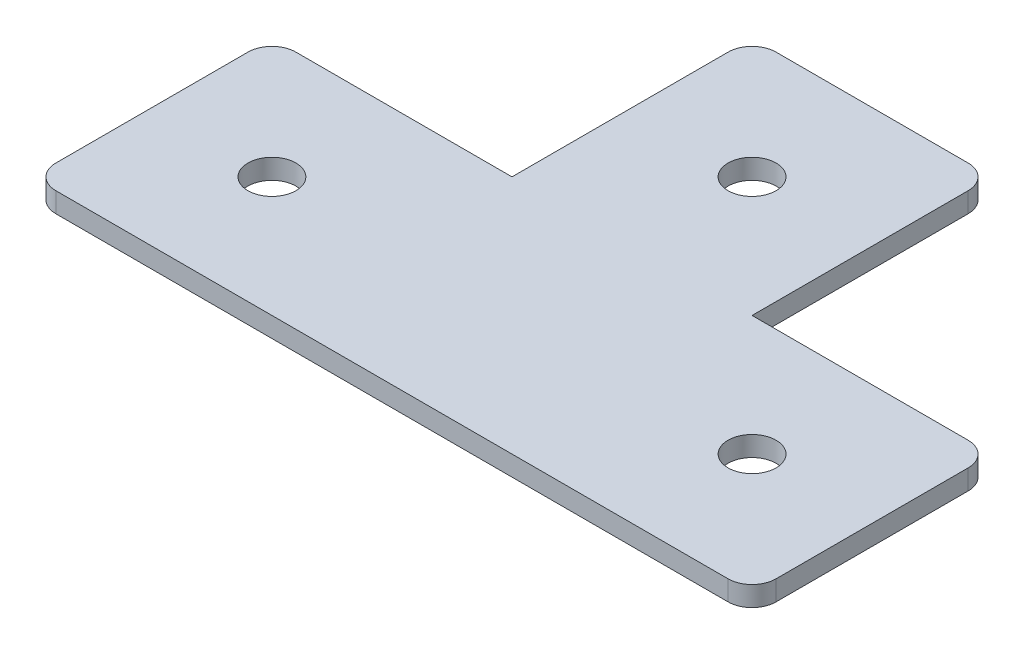
ISO-10303-21;
HEADER;
FILE_DESCRIPTION(('STEP AP214'),'2;1');
FILE_NAME('part.step','',(''),(''),'','','');
FILE_SCHEMA(('AUTOMOTIVE_DESIGN { 1 0 10303 214 1 1 1 1 }'));
ENDSEC;
DATA;
#1=APPLICATION_CONTEXT('core data for automotive mechanical design processes');
#2=APPLICATION_PROTOCOL_DEFINITION('international standard','automotive_design',2000,#1);
#3=PRODUCT_CONTEXT('',#1,'mechanical');
#4=PRODUCT('Part','Part','',(#3));
#5=PRODUCT_RELATED_PRODUCT_CATEGORY('part','',(#4));
#6=PRODUCT_DEFINITION_FORMATION('','',#4);
#7=PRODUCT_DEFINITION_CONTEXT('part definition',#1,'design');
#8=PRODUCT_DEFINITION('design','',#6,#7);
#9=PRODUCT_DEFINITION_SHAPE('','',#8);
#10=(LENGTH_UNIT() NAMED_UNIT(*) SI_UNIT(.MILLI.,.METRE.));
#11=(NAMED_UNIT(*) PLANE_ANGLE_UNIT() SI_UNIT($,.RADIAN.));
#12=(NAMED_UNIT(*) SI_UNIT($,.STERADIAN.) SOLID_ANGLE_UNIT());
#13=UNCERTAINTY_MEASURE_WITH_UNIT(LENGTH_MEASURE(1.E-05),#10,'distance_accuracy_value','');
#14=(GEOMETRIC_REPRESENTATION_CONTEXT(3) GLOBAL_UNCERTAINTY_ASSIGNED_CONTEXT((#13)) GLOBAL_UNIT_ASSIGNED_CONTEXT((#10,
#11,#12)) REPRESENTATION_CONTEXT('',''));
#15=CARTESIAN_POINT('',(0.,0.,0.));
#16=DIRECTION('',(0.,0.,1.));
#17=DIRECTION('',(1.,0.,0.));
#18=AXIS2_PLACEMENT_3D('',#15,#16,#17);
#19=CARTESIAN_POINT('',(-12.4698795180723,2.5,-24.8493975903614));
#20=DIRECTION('',(1.,0.,0.));
#21=DIRECTION('',(0.,0.,-1.));
#22=AXIS2_PLACEMENT_3D('',#19,#20,#21);
#23=PLANE('',#22);
#24=DIRECTION('',(0.,0.,1.));
#25=VECTOR('',#24,1.);
#26=CARTESIAN_POINT('',(-12.4698795180723,2.5,-24.8493975903614));
#27=LINE('',#26,#25);
#28=CARTESIAN_POINT('',(-12.4698795180723,2.5,-21.8493975903615));
#29=VERTEX_POINT('',#28);
#30=CARTESIAN_POINT('',(-12.4698795180723,2.5,5.15060240963856));
#31=VERTEX_POINT('',#30);
#32=EDGE_CURVE('E134',#29,#31,#27,.T.);
#33=ORIENTED_EDGE('',*,*,#32,.F.);
#34=DIRECTION('',(0.,-1.,0.));
#35=VECTOR('',#34,1.);
#36=CARTESIAN_POINT('',(-12.4698795180723,2.5,-21.8493975903615));
#37=LINE('',#36,#35);
#38=CARTESIAN_POINT('',(-12.4698795180723,0.,-21.8493975903615));
#39=VERTEX_POINT('',#38);
#40=EDGE_CURVE('E193',#29,#39,#37,.T.);
#41=ORIENTED_EDGE('',*,*,#40,.T.);
#42=DIRECTION('',(0.,0.,1.));
#43=VECTOR('',#42,1.);
#44=CARTESIAN_POINT('',(-12.4698795180723,0.,-24.8493975903614));
#45=LINE('',#44,#43);
#46=CARTESIAN_POINT('',(-12.4698795180723,0.,5.15060240963856));
#47=VERTEX_POINT('',#46);
#48=EDGE_CURVE('E158',#39,#47,#45,.T.);
#49=ORIENTED_EDGE('',*,*,#48,.T.);
#50=DIRECTION('',(0.,-1.,0.));
#51=VECTOR('',#50,1.);
#52=CARTESIAN_POINT('',(-12.4698795180723,2.5,5.15060240963856));
#53=LINE('',#52,#51);
#54=EDGE_CURVE('E152',#31,#47,#53,.T.);
#55=ORIENTED_EDGE('',*,*,#54,.F.);
#56=EDGE_LOOP('',(#33,#41,#49,#55));
#57=FACE_BOUND('',#56,.T.);
#58=ADVANCED_FACE('F33',(#57),#23,.F.);
#59=CARTESIAN_POINT('',(-12.4698795180723,2.5,5.15060240963856));
#60=DIRECTION('',(0.,0.,1.));
#61=DIRECTION('',(1.,0.,0.));
#62=AXIS2_PLACEMENT_3D('',#59,#60,#61);
#63=PLANE('',#62);
#64=DIRECTION('',(-1.,0.,0.));
#65=VECTOR('',#64,1.);
#66=CARTESIAN_POINT('',(-12.4698795180723,0.,5.15060240963856));
#67=LINE('',#66,#65);
#68=CARTESIAN_POINT('',(-39.4698795180723,0.,5.15060240963856));
#69=VERTEX_POINT('',#68);
#70=EDGE_CURVE('E250',#47,#69,#67,.T.);
#71=ORIENTED_EDGE('',*,*,#70,.T.);
#72=DIRECTION('',(0.,-1.,0.));
#73=VECTOR('',#72,1.);
#74=CARTESIAN_POINT('',(-39.4698795180723,2.5,5.15060240963856));
#75=LINE('',#74,#73);
#76=CARTESIAN_POINT('',(-39.4698795180723,2.5,5.15060240963856));
#77=VERTEX_POINT('',#76);
#78=EDGE_CURVE('E154',#69,#77,#75,.F.);
#79=ORIENTED_EDGE('',*,*,#78,.T.);
#80=DIRECTION('',(-1.,0.,0.));
#81=VECTOR('',#80,1.);
#82=CARTESIAN_POINT('',(-12.4698795180723,2.5,5.15060240963856));
#83=LINE('',#82,#81);
#84=EDGE_CURVE('E137',#31,#77,#83,.T.);
#85=ORIENTED_EDGE('',*,*,#84,.F.);
#86=ORIENTED_EDGE('',*,*,#54,.T.);
#87=EDGE_LOOP('',(#71,#79,#85,#86));
#88=FACE_BOUND('',#87,.T.);
#89=ADVANCED_FACE('F151',(#88),#63,.F.);
#90=CARTESIAN_POINT('',(-42.4698795180723,2.5,35.1506024096386));
#91=DIRECTION('',(1.,0.,0.));
#92=DIRECTION('',(0.,0.,-1.));
#93=AXIS2_PLACEMENT_3D('',#90,#91,#92);
#94=PLANE('',#93);
#95=DIRECTION('',(0.,0.,1.));
#96=VECTOR('',#95,1.);
#97=CARTESIAN_POINT('',(-42.4698795180723,0.,35.1506024096386));
#98=LINE('',#97,#96);
#99=CARTESIAN_POINT('',(-42.4698795180723,0.,8.15060240963856));
#100=VERTEX_POINT('',#99);
#101=CARTESIAN_POINT('',(-42.4698795180723,0.,32.1506024096385));
#102=VERTEX_POINT('',#101);
#103=EDGE_CURVE('E252',#100,#102,#98,.T.);
#104=ORIENTED_EDGE('',*,*,#103,.T.);
#105=DIRECTION('',(0.,-1.,0.));
#106=VECTOR('',#105,1.);
#107=CARTESIAN_POINT('',(-42.4698795180723,2.5,32.1506024096385));
#108=LINE('',#107,#106);
#109=CARTESIAN_POINT('',(-42.4698795180723,2.5,32.1506024096385));
#110=VERTEX_POINT('',#109);
#111=EDGE_CURVE('E180',#102,#110,#108,.F.);
#112=ORIENTED_EDGE('',*,*,#111,.T.);
#113=DIRECTION('',(0.,0.,1.));
#114=VECTOR('',#113,1.);
#115=CARTESIAN_POINT('',(-42.4698795180723,2.5,35.1506024096386));
#116=LINE('',#115,#114);
#117=CARTESIAN_POINT('',(-42.4698795180723,2.5,8.15060240963856));
#118=VERTEX_POINT('',#117);
#119=EDGE_CURVE('E155',#118,#110,#116,.T.);
#120=ORIENTED_EDGE('',*,*,#119,.F.);
#121=DIRECTION('',(0.,-1.,0.));
#122=VECTOR('',#121,1.);
#123=CARTESIAN_POINT('',(-42.4698795180723,2.5,8.15060240963856));
#124=LINE('',#123,#122);
#125=EDGE_CURVE('E160',#118,#100,#124,.T.);
#126=ORIENTED_EDGE('',*,*,#125,.T.);
#127=EDGE_LOOP('',(#104,#112,#120,#126));
#128=FACE_BOUND('',#127,.T.);
#129=ADVANCED_FACE('F299',(#128),#94,.F.);
#130=CARTESIAN_POINT('',(17.5301204819277,2.5,35.1506024096386));
#131=DIRECTION('',(0.,0.,-1.));
#132=DIRECTION('',(-1.,0.,0.));
#133=AXIS2_PLACEMENT_3D('',#130,#131,#132);
#134=PLANE('',#133);
#135=DIRECTION('',(1.,0.,0.));
#136=VECTOR('',#135,1.);
#137=CARTESIAN_POINT('',(17.5301204819277,0.,35.1506024096386));
#138=LINE('',#137,#136);
#139=CARTESIAN_POINT('',(-39.4698795180723,0.,35.1506024096386));
#140=VERTEX_POINT('',#139);
#141=CARTESIAN_POINT('',(44.5301204819277,0.,35.1506024096386));
#142=VERTEX_POINT('',#141);
#143=EDGE_CURVE('E238',#140,#142,#138,.T.);
#144=ORIENTED_EDGE('',*,*,#143,.T.);
#145=DIRECTION('',(0.,-1.,0.));
#146=VECTOR('',#145,1.);
#147=CARTESIAN_POINT('',(44.5301204819277,2.5,35.1506024096386));
#148=LINE('',#147,#146);
#149=CARTESIAN_POINT('',(44.5301204819277,2.5,35.1506024096385));
#150=VERTEX_POINT('',#149);
#151=EDGE_CURVE('E215',#142,#150,#148,.F.);
#152=ORIENTED_EDGE('',*,*,#151,.T.);
#153=DIRECTION('',(1.,0.,0.));
#154=VECTOR('',#153,1.);
#155=CARTESIAN_POINT('',(-12.4698795180723,2.5,35.1506024096386));
#156=LINE('',#155,#154);
#157=CARTESIAN_POINT('',(-39.4698795180723,2.5,35.1506024096386));
#158=VERTEX_POINT('',#157);
#159=EDGE_CURVE('E271',#158,#150,#156,.T.);
#160=ORIENTED_EDGE('',*,*,#159,.F.);
#161=DIRECTION('',(0.,-1.,0.));
#162=VECTOR('',#161,1.);
#163=CARTESIAN_POINT('',(-39.4698795180723,2.5,35.1506024096386));
#164=LINE('',#163,#162);
#165=EDGE_CURVE('E175',#158,#140,#164,.T.);
#166=ORIENTED_EDGE('',*,*,#165,.T.);
#167=EDGE_LOOP('',(#144,#152,#160,#166));
#168=FACE_BOUND('',#167,.T.);
#169=ADVANCED_FACE('F262',(#168),#134,.F.);
#170=CARTESIAN_POINT('',(47.5301204819277,2.5,35.1506024096386));
#171=DIRECTION('',(-1.,0.,0.));
#172=DIRECTION('',(0.,0.,1.));
#173=AXIS2_PLACEMENT_3D('',#170,#171,#172);
#174=PLANE('',#173);
#175=DIRECTION('',(0.,0.,-1.));
#176=VECTOR('',#175,1.);
#177=CARTESIAN_POINT('',(47.5301204819277,0.,35.1506024096386));
#178=LINE('',#177,#176);
#179=CARTESIAN_POINT('',(47.5301204819277,0.,32.1506024096385));
#180=VERTEX_POINT('',#179);
#181=CARTESIAN_POINT('',(47.5301204819277,0.,8.15060240963855));
#182=VERTEX_POINT('',#181);
#183=EDGE_CURVE('E235',#180,#182,#178,.T.);
#184=ORIENTED_EDGE('',*,*,#183,.T.);
#185=DIRECTION('',(0.,-1.,0.));
#186=VECTOR('',#185,1.);
#187=CARTESIAN_POINT('',(47.5301204819277,2.5,8.15060240963855));
#188=LINE('',#187,#186);
#189=CARTESIAN_POINT('',(47.5301204819277,2.5,8.15060240963855));
#190=VERTEX_POINT('',#189);
#191=EDGE_CURVE('E41',#182,#190,#188,.F.);
#192=ORIENTED_EDGE('',*,*,#191,.T.);
#193=DIRECTION('',(0.,0.,-1.));
#194=VECTOR('',#193,1.);
#195=CARTESIAN_POINT('',(47.5301204819277,2.5,35.1506024096386));
#196=LINE('',#195,#194);
#197=CARTESIAN_POINT('',(47.5301204819277,2.5,32.1506024096385));
#198=VERTEX_POINT('',#197);
#199=EDGE_CURVE('E270',#198,#190,#196,.T.);
#200=ORIENTED_EDGE('',*,*,#199,.F.);
#201=DIRECTION('',(0.,-1.,0.));
#202=VECTOR('',#201,1.);
#203=CARTESIAN_POINT('',(47.5301204819277,2.5,32.1506024096385));
#204=LINE('',#203,#202);
#205=EDGE_CURVE('E200',#198,#180,#204,.T.);
#206=ORIENTED_EDGE('',*,*,#205,.T.);
#207=EDGE_LOOP('',(#184,#192,#200,#206));
#208=FACE_BOUND('',#207,.T.);
#209=ADVANCED_FACE('F272',(#208),#174,.F.);
#210=CARTESIAN_POINT('',(17.5301204819277,2.5,5.15060240963855));
#211=DIRECTION('',(0.,0.,1.));
#212=DIRECTION('',(1.,0.,0.));
#213=AXIS2_PLACEMENT_3D('',#210,#211,#212);
#214=PLANE('',#213);
#215=DIRECTION('',(-1.,0.,0.));
#216=VECTOR('',#215,1.);
#217=CARTESIAN_POINT('',(17.5301204819277,2.5,5.15060240963855));
#218=LINE('',#217,#216);
#219=CARTESIAN_POINT('',(44.5301204819277,2.5,5.15060240963855));
#220=VERTEX_POINT('',#219);
#221=CARTESIAN_POINT('',(17.5301204819277,2.5,5.15060240963855));
#222=VERTEX_POINT('',#221);
#223=EDGE_CURVE('E228',#220,#222,#218,.T.);
#224=ORIENTED_EDGE('',*,*,#223,.F.);
#225=DIRECTION('',(0.,-1.,0.));
#226=VECTOR('',#225,1.);
#227=CARTESIAN_POINT('',(44.5301204819277,2.5,5.15060240963855));
#228=LINE('',#227,#226);
#229=CARTESIAN_POINT('',(44.5301204819277,0.,5.15060240963855));
#230=VERTEX_POINT('',#229);
#231=EDGE_CURVE('E219',#220,#230,#228,.T.);
#232=ORIENTED_EDGE('',*,*,#231,.T.);
#233=DIRECTION('',(-1.,0.,0.));
#234=VECTOR('',#233,1.);
#235=CARTESIAN_POINT('',(17.5301204819277,0.,5.15060240963855));
#236=LINE('',#235,#234);
#237=CARTESIAN_POINT('',(17.5301204819277,0.,5.15060240963855));
#238=VERTEX_POINT('',#237);
#239=EDGE_CURVE('E227',#230,#238,#236,.T.);
#240=ORIENTED_EDGE('',*,*,#239,.T.);
#241=DIRECTION('',(0.,-1.,0.));
#242=VECTOR('',#241,1.);
#243=CARTESIAN_POINT('',(17.5301204819277,2.5,5.15060240963855));
#244=LINE('',#243,#242);
#245=EDGE_CURVE('E161',#222,#238,#244,.T.);
#246=ORIENTED_EDGE('',*,*,#245,.F.);
#247=EDGE_LOOP('',(#224,#232,#240,#246));
#248=FACE_BOUND('',#247,.T.);
#249=ADVANCED_FACE('F225',(#248),#214,.F.);
#250=CARTESIAN_POINT('',(17.5301204819277,2.5,-24.8493975903614));
#251=DIRECTION('',(-1.,0.,0.));
#252=DIRECTION('',(0.,0.,1.));
#253=AXIS2_PLACEMENT_3D('',#250,#251,#252);
#254=PLANE('',#253);
#255=DIRECTION('',(0.,0.,-1.));
#256=VECTOR('',#255,1.);
#257=CARTESIAN_POINT('',(17.5301204819277,0.,-24.8493975903614));
#258=LINE('',#257,#256);
#259=CARTESIAN_POINT('',(17.5301204819277,0.,-21.8493975903615));
#260=VERTEX_POINT('',#259);
#261=EDGE_CURVE('E234',#238,#260,#258,.T.);
#262=ORIENTED_EDGE('',*,*,#261,.T.);
#263=DIRECTION('',(0.,-1.,0.));
#264=VECTOR('',#263,1.);
#265=CARTESIAN_POINT('',(17.5301204819277,2.5,-21.8493975903615));
#266=LINE('',#265,#264);
#267=CARTESIAN_POINT('',(17.5301204819277,2.5,-21.8493975903615));
#268=VERTEX_POINT('',#267);
#269=EDGE_CURVE('E189',#260,#268,#266,.F.);
#270=ORIENTED_EDGE('',*,*,#269,.T.);
#271=DIRECTION('',(0.,0.,-1.));
#272=VECTOR('',#271,1.);
#273=CARTESIAN_POINT('',(17.5301204819277,2.5,-24.8493975903614));
#274=LINE('',#273,#272);
#275=EDGE_CURVE('E274',#222,#268,#274,.T.);
#276=ORIENTED_EDGE('',*,*,#275,.F.);
#277=ORIENTED_EDGE('',*,*,#245,.T.);
#278=EDGE_LOOP('',(#262,#270,#276,#277));
#279=FACE_BOUND('',#278,.T.);
#280=ADVANCED_FACE('F285',(#279),#254,.F.);
#281=CARTESIAN_POINT('',(-12.4698795180723,2.5,-24.8493975903614));
#282=DIRECTION('',(0.,0.,1.));
#283=DIRECTION('',(1.,0.,0.));
#284=AXIS2_PLACEMENT_3D('',#281,#282,#283);
#285=PLANE('',#284);
#286=DIRECTION('',(-1.,0.,0.));
#287=VECTOR('',#286,1.);
#288=CARTESIAN_POINT('',(-12.4698795180723,0.,-24.8493975903614));
#289=LINE('',#288,#287);
#290=CARTESIAN_POINT('',(14.5301204819277,0.,-24.8493975903614));
#291=VERTEX_POINT('',#290);
#292=CARTESIAN_POINT('',(-9.4698795180723,0.,-24.8493975903614));
#293=VERTEX_POINT('',#292);
#294=EDGE_CURVE('E146',#291,#293,#289,.T.);
#295=ORIENTED_EDGE('',*,*,#294,.T.);
#296=DIRECTION('',(0.,-1.,0.));
#297=VECTOR('',#296,1.);
#298=CARTESIAN_POINT('',(-9.4698795180723,2.5,-24.8493975903614));
#299=LINE('',#298,#297);
#300=CARTESIAN_POINT('',(-9.4698795180723,2.5,-24.8493975903614));
#301=VERTEX_POINT('',#300);
#302=EDGE_CURVE('E197',#293,#301,#299,.F.);
#303=ORIENTED_EDGE('',*,*,#302,.T.);
#304=DIRECTION('',(-1.,0.,0.));
#305=VECTOR('',#304,1.);
#306=CARTESIAN_POINT('',(-12.4698795180723,2.5,-24.8493975903614));
#307=LINE('',#306,#305);
#308=CARTESIAN_POINT('',(14.5301204819277,2.5,-24.8493975903614));
#309=VERTEX_POINT('',#308);
#310=EDGE_CURVE('E167',#309,#301,#307,.T.);
#311=ORIENTED_EDGE('',*,*,#310,.F.);
#312=DIRECTION('',(0.,-1.,0.));
#313=VECTOR('',#312,1.);
#314=CARTESIAN_POINT('',(14.5301204819277,2.5,-24.8493975903614));
#315=LINE('',#314,#313);
#316=EDGE_CURVE('E184',#309,#291,#315,.T.);
#317=ORIENTED_EDGE('',*,*,#316,.T.);
#318=EDGE_LOOP('',(#295,#303,#311,#317));
#319=FACE_BOUND('',#318,.T.);
#320=ADVANCED_FACE('F245',(#319),#285,.F.);
#321=CARTESIAN_POINT('',(0.,2.5,0.));
#322=DIRECTION('',(0.,-1.,0.));
#323=DIRECTION('',(0.,0.,-1.));
#324=AXIS2_PLACEMENT_3D('',#321,#322,#323);
#325=PLANE('',#324);
#326=CARTESIAN_POINT('',(2.5301204819277,2.5,-9.84939759036145));
#327=DIRECTION('',(0.,1.,0.));
#328=DIRECTION('',(0.,0.,1.));
#329=AXIS2_PLACEMENT_3D('',#326,#327,#328);
#330=CIRCLE('',#329,3.);
#331=CARTESIAN_POINT('',(2.5301204819277,2.5,-6.84939759036145));
#332=VERTEX_POINT('',#331);
#333=EDGE_CURVE('E205',#332,#332,#330,.T.);
#334=ORIENTED_EDGE('',*,*,#333,.F.);
#335=EDGE_LOOP('',(#334));
#336=FACE_BOUND('',#335,.T.);
#337=CARTESIAN_POINT('',(-27.4698795180723,2.5,20.1506024096386));
#338=DIRECTION('',(0.,1.,0.));
#339=DIRECTION('',(0.,0.,1.));
#340=AXIS2_PLACEMENT_3D('',#337,#338,#339);
#341=CIRCLE('',#340,3.);
#342=CARTESIAN_POINT('',(-27.4698795180723,2.5,23.1506024096386));
#343=VERTEX_POINT('',#342);
#344=EDGE_CURVE('E351',#343,#343,#341,.T.);
#345=ORIENTED_EDGE('',*,*,#344,.F.);
#346=EDGE_LOOP('',(#345));
#347=FACE_BOUND('',#346,.T.);
#348=CARTESIAN_POINT('',(32.5301204819277,2.5,20.1506024096386));
#349=DIRECTION('',(0.,1.,0.));
#350=DIRECTION('',(0.,0.,1.));
#351=AXIS2_PLACEMENT_3D('',#348,#349,#350);
#352=CIRCLE('',#351,3.);
#353=CARTESIAN_POINT('',(32.5301204819277,2.5,23.1506024096386));
#354=VERTEX_POINT('',#353);
#355=EDGE_CURVE('E349',#354,#354,#352,.T.);
#356=ORIENTED_EDGE('',*,*,#355,.F.);
#357=EDGE_LOOP('',(#356));
#358=FACE_BOUND('',#357,.T.);
#359=ORIENTED_EDGE('',*,*,#199,.T.);
#360=CARTESIAN_POINT('',(44.5301204819277,2.5,8.15060240963855));
#361=DIRECTION('',(0.,-1.,0.));
#362=DIRECTION('',(0.,0.,-1.));
#363=AXIS2_PLACEMENT_3D('',#360,#361,#362);
#364=CIRCLE('',#363,3.);
#365=EDGE_CURVE('E11',#190,#220,#364,.F.);
#366=ORIENTED_EDGE('',*,*,#365,.T.);
#367=ORIENTED_EDGE('',*,*,#223,.T.);
#368=ORIENTED_EDGE('',*,*,#275,.T.);
#369=CARTESIAN_POINT('',(14.5301204819277,2.5,-21.8493975903615));
#370=DIRECTION('',(0.,-1.,0.));
#371=DIRECTION('',(0.,0.,-1.));
#372=AXIS2_PLACEMENT_3D('',#369,#370,#371);
#373=CIRCLE('',#372,3.);
#374=EDGE_CURVE('E191',#268,#309,#373,.F.);
#375=ORIENTED_EDGE('',*,*,#374,.T.);
#376=ORIENTED_EDGE('',*,*,#310,.T.);
#377=CARTESIAN_POINT('',(-9.4698795180723,2.5,-21.8493975903615));
#378=DIRECTION('',(0.,-1.,0.));
#379=DIRECTION('',(0.,0.,-1.));
#380=AXIS2_PLACEMENT_3D('',#377,#378,#379);
#381=CIRCLE('',#380,3.);
#382=EDGE_CURVE('E141',#301,#29,#381,.F.);
#383=ORIENTED_EDGE('',*,*,#382,.T.);
#384=ORIENTED_EDGE('',*,*,#32,.T.);
#385=ORIENTED_EDGE('',*,*,#84,.T.);
#386=CARTESIAN_POINT('',(-39.4698795180723,2.5,8.15060240963856));
#387=DIRECTION('',(0.,-1.,0.));
#388=DIRECTION('',(0.,0.,-1.));
#389=AXIS2_PLACEMENT_3D('',#386,#387,#388);
#390=CIRCLE('',#389,3.);
#391=EDGE_CURVE('E173',#77,#118,#390,.F.);
#392=ORIENTED_EDGE('',*,*,#391,.T.);
#393=ORIENTED_EDGE('',*,*,#119,.T.);
#394=CARTESIAN_POINT('',(-39.4698795180723,2.5,32.1506024096385));
#395=DIRECTION('',(0.,-1.,0.));
#396=DIRECTION('',(0.,0.,-1.));
#397=AXIS2_PLACEMENT_3D('',#394,#395,#396);
#398=CIRCLE('',#397,3.);
#399=EDGE_CURVE('E182',#110,#158,#398,.F.);
#400=ORIENTED_EDGE('',*,*,#399,.T.);
#401=ORIENTED_EDGE('',*,*,#159,.T.);
#402=CARTESIAN_POINT('',(44.5301204819277,2.5,32.1506024096385));
#403=DIRECTION('',(0.,-1.,0.));
#404=DIRECTION('',(0.,0.,-1.));
#405=AXIS2_PLACEMENT_3D('',#402,#403,#404);
#406=CIRCLE('',#405,3.);
#407=EDGE_CURVE('E217',#150,#198,#406,.F.);
#408=ORIENTED_EDGE('',*,*,#407,.T.);
#409=EDGE_LOOP('',(#359,#366,#367,#368,#375,#376,#383,#384,#385,#392,#393,#400,#401,#408));
#410=FACE_BOUND('',#409,.T.);
#411=ADVANCED_FACE('F136',(#336,#347,#358,#410),#325,.F.);
#412=CARTESIAN_POINT('',(0.,0.,0.));
#413=DIRECTION('',(0.,-1.,0.));
#414=DIRECTION('',(0.,0.,-1.));
#415=AXIS2_PLACEMENT_3D('',#412,#413,#414);
#416=PLANE('',#415);
#417=CARTESIAN_POINT('',(2.5301204819277,0.,-9.84939759036145));
#418=DIRECTION('',(0.,-1.,0.));
#419=DIRECTION('',(0.,0.,-1.));
#420=AXIS2_PLACEMENT_3D('',#417,#418,#419);
#421=CIRCLE('',#420,3.);
#422=CARTESIAN_POINT('',(2.5301204819277,0.,-12.8493975903615));
#423=VERTEX_POINT('',#422);
#424=EDGE_CURVE('E208',#423,#423,#421,.T.);
#425=ORIENTED_EDGE('',*,*,#424,.F.);
#426=EDGE_LOOP('',(#425));
#427=FACE_BOUND('',#426,.T.);
#428=CARTESIAN_POINT('',(-27.4698795180723,0.,20.1506024096386));
#429=DIRECTION('',(0.,-1.,0.));
#430=DIRECTION('',(0.,0.,-1.));
#431=AXIS2_PLACEMENT_3D('',#428,#429,#430);
#432=CIRCLE('',#431,3.);
#433=CARTESIAN_POINT('',(-27.4698795180723,0.,17.1506024096386));
#434=VERTEX_POINT('',#433);
#435=EDGE_CURVE('E204',#434,#434,#432,.T.);
#436=ORIENTED_EDGE('',*,*,#435,.F.);
#437=EDGE_LOOP('',(#436));
#438=FACE_BOUND('',#437,.T.);
#439=CARTESIAN_POINT('',(32.5301204819277,0.,20.1506024096386));
#440=DIRECTION('',(0.,-1.,0.));
#441=DIRECTION('',(0.,0.,-1.));
#442=AXIS2_PLACEMENT_3D('',#439,#440,#441);
#443=CIRCLE('',#442,3.);
#444=CARTESIAN_POINT('',(32.5301204819277,0.,17.1506024096386));
#445=VERTEX_POINT('',#444);
#446=EDGE_CURVE('E201',#445,#445,#443,.T.);
#447=ORIENTED_EDGE('',*,*,#446,.F.);
#448=EDGE_LOOP('',(#447));
#449=FACE_BOUND('',#448,.T.);
#450=ORIENTED_EDGE('',*,*,#239,.F.);
#451=CARTESIAN_POINT('',(44.5301204819277,0.,8.15060240963855));
#452=DIRECTION('',(0.,-1.,0.));
#453=DIRECTION('',(0.,0.,-1.));
#454=AXIS2_PLACEMENT_3D('',#451,#452,#453);
#455=CIRCLE('',#454,3.);
#456=EDGE_CURVE('E55',#230,#182,#455,.T.);
#457=ORIENTED_EDGE('',*,*,#456,.T.);
#458=ORIENTED_EDGE('',*,*,#183,.F.);
#459=CARTESIAN_POINT('',(44.5301204819277,0.,32.1506024096385));
#460=DIRECTION('',(0.,-1.,0.));
#461=DIRECTION('',(0.,0.,-1.));
#462=AXIS2_PLACEMENT_3D('',#459,#460,#461);
#463=CIRCLE('',#462,3.);
#464=EDGE_CURVE('E213',#180,#142,#463,.T.);
#465=ORIENTED_EDGE('',*,*,#464,.T.);
#466=ORIENTED_EDGE('',*,*,#143,.F.);
#467=CARTESIAN_POINT('',(-39.4698795180723,0.,32.1506024096385));
#468=DIRECTION('',(0.,-1.,0.));
#469=DIRECTION('',(0.,0.,-1.));
#470=AXIS2_PLACEMENT_3D('',#467,#468,#469);
#471=CIRCLE('',#470,3.);
#472=EDGE_CURVE('E178',#140,#102,#471,.T.);
#473=ORIENTED_EDGE('',*,*,#472,.T.);
#474=ORIENTED_EDGE('',*,*,#103,.F.);
#475=CARTESIAN_POINT('',(-39.4698795180723,0.,8.15060240963856));
#476=DIRECTION('',(0.,-1.,0.));
#477=DIRECTION('',(0.,0.,-1.));
#478=AXIS2_PLACEMENT_3D('',#475,#476,#477);
#479=CIRCLE('',#478,3.);
#480=EDGE_CURVE('E164',#100,#69,#479,.T.);
#481=ORIENTED_EDGE('',*,*,#480,.T.);
#482=ORIENTED_EDGE('',*,*,#70,.F.);
#483=ORIENTED_EDGE('',*,*,#48,.F.);
#484=CARTESIAN_POINT('',(-9.4698795180723,0.,-21.8493975903615));
#485=DIRECTION('',(0.,-1.,0.));
#486=DIRECTION('',(0.,0.,-1.));
#487=AXIS2_PLACEMENT_3D('',#484,#485,#486);
#488=CIRCLE('',#487,3.);
#489=EDGE_CURVE('E195',#39,#293,#488,.T.);
#490=ORIENTED_EDGE('',*,*,#489,.T.);
#491=ORIENTED_EDGE('',*,*,#294,.F.);
#492=CARTESIAN_POINT('',(14.5301204819277,0.,-21.8493975903615));
#493=DIRECTION('',(0.,-1.,0.));
#494=DIRECTION('',(0.,0.,-1.));
#495=AXIS2_PLACEMENT_3D('',#492,#493,#494);
#496=CIRCLE('',#495,3.);
#497=EDGE_CURVE('E187',#291,#260,#496,.T.);
#498=ORIENTED_EDGE('',*,*,#497,.T.);
#499=ORIENTED_EDGE('',*,*,#261,.F.);
#500=EDGE_LOOP('',(#450,#457,#458,#465,#466,#473,#474,#481,#482,#483,#490,#491,#498,#499));
#501=FACE_BOUND('',#500,.T.);
#502=ADVANCED_FACE('F232',(#427,#438,#449,#501),#416,.T.);
#503=CARTESIAN_POINT('',(-39.4698795180723,2.5,8.15060240963856));
#504=DIRECTION('',(0.,-1.,0.));
#505=DIRECTION('',(0.,0.,-1.));
#506=AXIS2_PLACEMENT_3D('',#503,#504,#505);
#507=CYLINDRICAL_SURFACE('',#506,3.);
#508=ORIENTED_EDGE('',*,*,#391,.F.);
#509=ORIENTED_EDGE('',*,*,#78,.F.);
#510=ORIENTED_EDGE('',*,*,#480,.F.);
#511=ORIENTED_EDGE('',*,*,#125,.F.);
#512=EDGE_LOOP('',(#508,#509,#510,#511));
#513=FACE_BOUND('',#512,.T.);
#514=ADVANCED_FACE('F303',(#513),#507,.T.);
#515=CARTESIAN_POINT('',(-39.4698795180723,2.5,32.1506024096385));
#516=DIRECTION('',(0.,-1.,0.));
#517=DIRECTION('',(0.,0.,-1.));
#518=AXIS2_PLACEMENT_3D('',#515,#516,#517);
#519=CYLINDRICAL_SURFACE('',#518,3.);
#520=ORIENTED_EDGE('',*,*,#399,.F.);
#521=ORIENTED_EDGE('',*,*,#111,.F.);
#522=ORIENTED_EDGE('',*,*,#472,.F.);
#523=ORIENTED_EDGE('',*,*,#165,.F.);
#524=EDGE_LOOP('',(#520,#521,#522,#523));
#525=FACE_BOUND('',#524,.T.);
#526=ADVANCED_FACE('F306',(#525),#519,.T.);
#527=CARTESIAN_POINT('',(14.5301204819277,2.5,-21.8493975903615));
#528=DIRECTION('',(0.,-1.,0.));
#529=DIRECTION('',(0.,0.,-1.));
#530=AXIS2_PLACEMENT_3D('',#527,#528,#529);
#531=CYLINDRICAL_SURFACE('',#530,3.);
#532=ORIENTED_EDGE('',*,*,#374,.F.);
#533=ORIENTED_EDGE('',*,*,#269,.F.);
#534=ORIENTED_EDGE('',*,*,#497,.F.);
#535=ORIENTED_EDGE('',*,*,#316,.F.);
#536=EDGE_LOOP('',(#532,#533,#534,#535));
#537=FACE_BOUND('',#536,.T.);
#538=ADVANCED_FACE('F282',(#537),#531,.T.);
#539=CARTESIAN_POINT('',(-9.4698795180723,2.5,-21.8493975903615));
#540=DIRECTION('',(0.,-1.,0.));
#541=DIRECTION('',(0.,0.,-1.));
#542=AXIS2_PLACEMENT_3D('',#539,#540,#541);
#543=CYLINDRICAL_SURFACE('',#542,3.);
#544=ORIENTED_EDGE('',*,*,#382,.F.);
#545=ORIENTED_EDGE('',*,*,#302,.F.);
#546=ORIENTED_EDGE('',*,*,#489,.F.);
#547=ORIENTED_EDGE('',*,*,#40,.F.);
#548=EDGE_LOOP('',(#544,#545,#546,#547));
#549=FACE_BOUND('',#548,.T.);
#550=ADVANCED_FACE('F249',(#549),#543,.T.);
#551=CARTESIAN_POINT('',(32.5301204819277,-0.5,20.1506024096386));
#552=DIRECTION('',(0.,1.,0.));
#553=DIRECTION('',(0.,0.,1.));
#554=AXIS2_PLACEMENT_3D('',#551,#552,#553);
#555=CYLINDRICAL_SURFACE('',#554,3.);
#556=ORIENTED_EDGE('',*,*,#446,.T.);
#557=EDGE_LOOP('',(#556));
#558=FACE_BOUND('',#557,.T.);
#559=ORIENTED_EDGE('',*,*,#355,.T.);
#560=EDGE_LOOP('',(#559));
#561=FACE_BOUND('',#560,.T.);
#562=ADVANCED_FACE('F314',(#558,#561),#555,.F.);
#563=CARTESIAN_POINT('',(-27.4698795180723,-0.5,20.1506024096386));
#564=DIRECTION('',(0.,1.,0.));
#565=DIRECTION('',(0.,0.,1.));
#566=AXIS2_PLACEMENT_3D('',#563,#564,#565);
#567=CYLINDRICAL_SURFACE('',#566,3.);
#568=ORIENTED_EDGE('',*,*,#435,.T.);
#569=EDGE_LOOP('',(#568));
#570=FACE_BOUND('',#569,.T.);
#571=ORIENTED_EDGE('',*,*,#344,.T.);
#572=EDGE_LOOP('',(#571));
#573=FACE_BOUND('',#572,.T.);
#574=ADVANCED_FACE('F321',(#570,#573),#567,.F.);
#575=CARTESIAN_POINT('',(2.5301204819277,-0.5,-9.84939759036145));
#576=DIRECTION('',(0.,1.,0.));
#577=DIRECTION('',(0.,0.,1.));
#578=AXIS2_PLACEMENT_3D('',#575,#576,#577);
#579=CYLINDRICAL_SURFACE('',#578,3.);
#580=ORIENTED_EDGE('',*,*,#424,.T.);
#581=EDGE_LOOP('',(#580));
#582=FACE_BOUND('',#581,.T.);
#583=ORIENTED_EDGE('',*,*,#333,.T.);
#584=EDGE_LOOP('',(#583));
#585=FACE_BOUND('',#584,.T.);
#586=ADVANCED_FACE('F316',(#582,#585),#579,.F.);
#587=CARTESIAN_POINT('',(44.5301204819277,2.5,32.1506024096385));
#588=DIRECTION('',(0.,-1.,0.));
#589=DIRECTION('',(0.,0.,-1.));
#590=AXIS2_PLACEMENT_3D('',#587,#588,#589);
#591=CYLINDRICAL_SURFACE('',#590,3.);
#592=ORIENTED_EDGE('',*,*,#407,.F.);
#593=ORIENTED_EDGE('',*,*,#151,.F.);
#594=ORIENTED_EDGE('',*,*,#464,.F.);
#595=ORIENTED_EDGE('',*,*,#205,.F.);
#596=EDGE_LOOP('',(#592,#593,#594,#595));
#597=FACE_BOUND('',#596,.T.);
#598=ADVANCED_FACE('F268',(#597),#591,.T.);
#599=CARTESIAN_POINT('',(44.5301204819277,2.5,8.15060240963855));
#600=DIRECTION('',(0.,-1.,0.));
#601=DIRECTION('',(0.,0.,-1.));
#602=AXIS2_PLACEMENT_3D('',#599,#600,#601);
#603=CYLINDRICAL_SURFACE('',#602,3.);
#604=ORIENTED_EDGE('',*,*,#365,.F.);
#605=ORIENTED_EDGE('',*,*,#191,.F.);
#606=ORIENTED_EDGE('',*,*,#456,.F.);
#607=ORIENTED_EDGE('',*,*,#231,.F.);
#608=EDGE_LOOP('',(#604,#605,#606,#607));
#609=FACE_BOUND('',#608,.T.);
#610=ADVANCED_FACE('F35',(#609),#603,.T.);
#611=CLOSED_SHELL('',(#58,#89,#129,#169,#209,#249,#280,#320,#411,#502,#514,#526,#538,#550,#562,
#574,#586,#598,#610));
#612=MANIFOLD_SOLID_BREP('B2',#611);
#613=ADVANCED_BREP_SHAPE_REPRESENTATION('',(#18,#612),#14);
#614=SHAPE_DEFINITION_REPRESENTATION(#9,#613);
ENDSEC;
END-ISO-10303-21;
